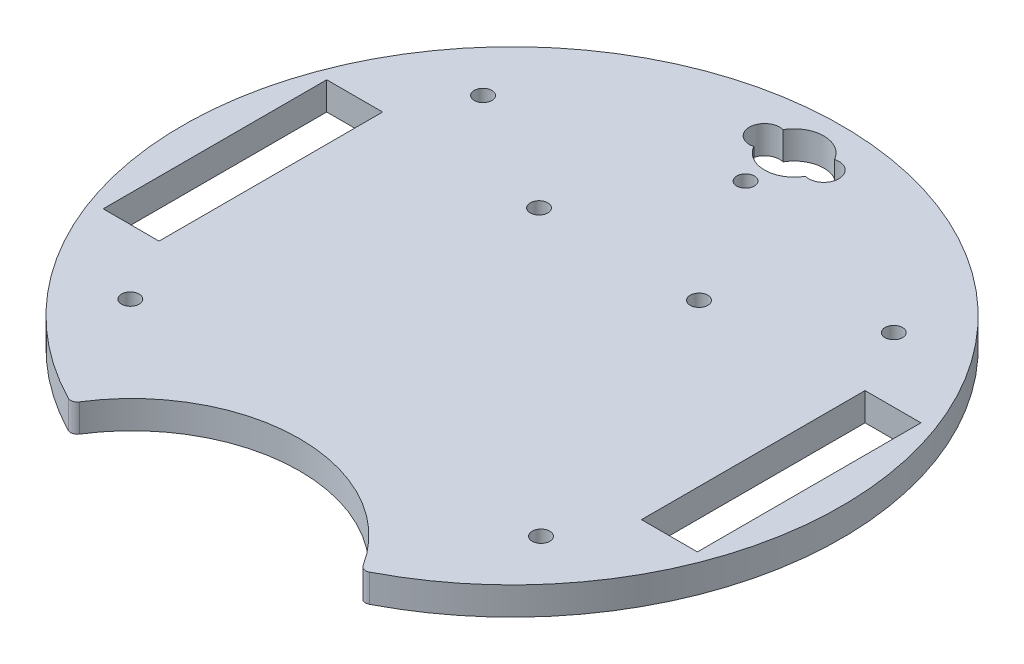
ISO-10303-21;
HEADER;
FILE_DESCRIPTION(('STEP AP214'),'2;1');
FILE_NAME('part.step','',(''),(''),'','','');
FILE_SCHEMA(('AUTOMOTIVE_DESIGN { 1 0 10303 214 1 1 1 1 }'));
ENDSEC;
DATA;
#1=APPLICATION_CONTEXT('core data for automotive mechanical design processes');
#2=APPLICATION_PROTOCOL_DEFINITION('international standard','automotive_design',2000,#1);
#3=PRODUCT_CONTEXT('',#1,'mechanical');
#4=PRODUCT('Part','Part','',(#3));
#5=PRODUCT_RELATED_PRODUCT_CATEGORY('part','',(#4));
#6=PRODUCT_DEFINITION_FORMATION('','',#4);
#7=PRODUCT_DEFINITION_CONTEXT('part definition',#1,'design');
#8=PRODUCT_DEFINITION('design','',#6,#7);
#9=PRODUCT_DEFINITION_SHAPE('','',#8);
#10=(LENGTH_UNIT() NAMED_UNIT(*) SI_UNIT(.MILLI.,.METRE.));
#11=(NAMED_UNIT(*) PLANE_ANGLE_UNIT() SI_UNIT($,.RADIAN.));
#12=(NAMED_UNIT(*) SI_UNIT($,.STERADIAN.) SOLID_ANGLE_UNIT());
#13=UNCERTAINTY_MEASURE_WITH_UNIT(LENGTH_MEASURE(1.E-05),#10,'distance_accuracy_value','');
#14=(GEOMETRIC_REPRESENTATION_CONTEXT(3) GLOBAL_UNCERTAINTY_ASSIGNED_CONTEXT((#13)) GLOBAL_UNIT_ASSIGNED_CONTEXT((#10,
#11,#12)) REPRESENTATION_CONTEXT('',''));
#15=CARTESIAN_POINT('',(0.,0.,0.));
#16=DIRECTION('',(0.,0.,1.));
#17=DIRECTION('',(1.,0.,0.));
#18=AXIS2_PLACEMENT_3D('',#15,#16,#17);
#19=CARTESIAN_POINT('',(0.,6.35,-64.1076988434385));
#20=DIRECTION('',(0.,-1.,0.));
#21=DIRECTION('',(0.,0.,-1.));
#22=AXIS2_PLACEMENT_3D('',#19,#20,#21);
#23=CYLINDRICAL_SURFACE('',#22,6.731);
#24=CARTESIAN_POINT('',(0.,0.,-64.1076988434385));
#25=DIRECTION('',(0.,1.,0.));
#26=DIRECTION('',(0.,0.,1.));
#27=AXIS2_PLACEMENT_3D('',#24,#25,#26);
#28=CIRCLE('',#27,6.731);
#29=CARTESIAN_POINT('',(-5.85389998799957,0.,-60.7853177800295));
#30=VERTEX_POINT('',#29);
#31=CARTESIAN_POINT('',(5.85757547169812,0.,-60.7918021934567));
#32=VERTEX_POINT('',#31);
#33=EDGE_CURVE('E234',#30,#32,#28,.T.);
#34=ORIENTED_EDGE('',*,*,#33,.F.);
#35=DIRECTION('',(0.,-1.,0.));
#36=VECTOR('',#35,1.);
#37=CARTESIAN_POINT('',(-5.85389998799957,6.35,-60.7853177800295));
#38=LINE('',#37,#36);
#39=CARTESIAN_POINT('',(-5.85389998799957,6.35,-60.7853177800295));
#40=VERTEX_POINT('',#39);
#41=EDGE_CURVE('E11',#40,#30,#38,.T.);
#42=ORIENTED_EDGE('',*,*,#41,.F.);
#43=CARTESIAN_POINT('',(0.,6.35,-64.1076988434385));
#44=DIRECTION('',(0.,1.,0.));
#45=DIRECTION('',(0.,0.,1.));
#46=AXIS2_PLACEMENT_3D('',#43,#44,#45);
#47=CIRCLE('',#46,6.731);
#48=CARTESIAN_POINT('',(5.85757547169812,6.35,-60.7918021934567));
#49=VERTEX_POINT('',#48);
#50=EDGE_CURVE('E169',#40,#49,#47,.T.);
#51=ORIENTED_EDGE('',*,*,#50,.T.);
#52=DIRECTION('',(0.,-1.,0.));
#53=VECTOR('',#52,1.);
#54=CARTESIAN_POINT('',(5.85757547169812,6.35,-60.7918021934567));
#55=LINE('',#54,#53);
#56=EDGE_CURVE('E52',#49,#32,#55,.T.);
#57=ORIENTED_EDGE('',*,*,#56,.T.);
#58=EDGE_LOOP('',(#34,#42,#51,#57));
#59=FACE_BOUND('',#58,.T.);
#60=ADVANCED_FACE('F33',(#59),#23,.F.);
#61=CARTESIAN_POINT('',(-6.731,6.35,-64.1076988434385));
#62=DIRECTION('',(0.,-1.,0.));
#63=DIRECTION('',(0.,0.,-1.));
#64=AXIS2_PLACEMENT_3D('',#61,#62,#63);
#65=CYLINDRICAL_SURFACE('',#64,3.43620726405579);
#66=CARTESIAN_POINT('',(-6.731,0.,-64.1076988434385));
#67=DIRECTION('',(0.,1.,0.));
#68=DIRECTION('',(0.,0.,1.));
#69=AXIS2_PLACEMENT_3D('',#66,#67,#68);
#70=CIRCLE('',#69,3.43620726405579);
#71=CARTESIAN_POINT('',(-5.85389998799957,0.,-67.4300799068475));
#72=VERTEX_POINT('',#71);
#73=EDGE_CURVE('E157',#72,#30,#70,.T.);
#74=ORIENTED_EDGE('',*,*,#73,.F.);
#75=DIRECTION('',(0.,-1.,0.));
#76=VECTOR('',#75,1.);
#77=CARTESIAN_POINT('',(-5.85389998799957,6.35,-67.4300799068475));
#78=LINE('',#77,#76);
#79=CARTESIAN_POINT('',(-5.85389998799957,6.35,-67.4300799068475));
#80=VERTEX_POINT('',#79);
#81=EDGE_CURVE('E43',#80,#72,#78,.T.);
#82=ORIENTED_EDGE('',*,*,#81,.F.);
#83=CARTESIAN_POINT('',(-6.731,6.35,-64.1076988434385));
#84=DIRECTION('',(0.,1.,0.));
#85=DIRECTION('',(0.,0.,1.));
#86=AXIS2_PLACEMENT_3D('',#83,#84,#85);
#87=CIRCLE('',#86,3.43620726405579);
#88=EDGE_CURVE('E155',#80,#40,#87,.T.);
#89=ORIENTED_EDGE('',*,*,#88,.T.);
#90=ORIENTED_EDGE('',*,*,#41,.T.);
#91=EDGE_LOOP('',(#74,#82,#89,#90));
#92=FACE_BOUND('',#91,.T.);
#93=ADVANCED_FACE('F154',(#92),#65,.F.);
#94=CARTESIAN_POINT('',(0.,6.35,-64.1076988434385));
#95=DIRECTION('',(0.,-1.,0.));
#96=DIRECTION('',(0.,0.,-1.));
#97=AXIS2_PLACEMENT_3D('',#94,#95,#96);
#98=CYLINDRICAL_SURFACE('',#97,6.731);
#99=CARTESIAN_POINT('',(0.,0.,-64.1076988434385));
#100=DIRECTION('',(0.,1.,0.));
#101=DIRECTION('',(0.,0.,1.));
#102=AXIS2_PLACEMENT_3D('',#99,#100,#101);
#103=CIRCLE('',#102,6.731);
#104=CARTESIAN_POINT('',(5.8575754716981,0.,-67.4235954934203));
#105=VERTEX_POINT('',#104);
#106=EDGE_CURVE('E237',#105,#72,#103,.T.);
#107=ORIENTED_EDGE('',*,*,#106,.F.);
#108=DIRECTION('',(0.,-1.,0.));
#109=VECTOR('',#108,1.);
#110=CARTESIAN_POINT('',(5.8575754716981,6.35,-67.4235954934203));
#111=LINE('',#110,#109);
#112=CARTESIAN_POINT('',(5.8575754716981,6.35,-67.4235954934203));
#113=VERTEX_POINT('',#112);
#114=EDGE_CURVE('E101',#113,#105,#111,.T.);
#115=ORIENTED_EDGE('',*,*,#114,.F.);
#116=CARTESIAN_POINT('',(0.,6.35,-64.1076988434385));
#117=DIRECTION('',(0.,1.,0.));
#118=DIRECTION('',(0.,0.,1.));
#119=AXIS2_PLACEMENT_3D('',#116,#117,#118);
#120=CIRCLE('',#119,6.731);
#121=EDGE_CURVE('E168',#113,#80,#120,.T.);
#122=ORIENTED_EDGE('',*,*,#121,.T.);
#123=ORIENTED_EDGE('',*,*,#81,.T.);
#124=EDGE_LOOP('',(#107,#115,#122,#123));
#125=FACE_BOUND('',#124,.T.);
#126=ADVANCED_FACE('F171',(#125),#98,.F.);
#127=CARTESIAN_POINT('',(0.,6.35,-25.4000000000001));
#128=DIRECTION('',(0.,0.,-1.));
#129=DIRECTION('',(-1.,0.,0.));
#130=AXIS2_PLACEMENT_3D('',#127,#128,#129);
#131=PLANE('',#130);
#132=DIRECTION('',(1.,0.,0.));
#133=VECTOR('',#132,1.);
#134=CARTESIAN_POINT('',(0.,0.,-25.4000000000001));
#135=LINE('',#134,#133);
#136=CARTESIAN_POINT('',(-67.5141237268841,0.,-25.4000000000001));
#137=VERTEX_POINT('',#136);
#138=CARTESIAN_POINT('',(-54.8141237268841,0.,-25.4000000000001));
#139=VERTEX_POINT('',#138);
#140=EDGE_CURVE('E223',#137,#139,#135,.T.);
#141=ORIENTED_EDGE('',*,*,#140,.T.);
#142=DIRECTION('',(0.,-1.,0.));
#143=VECTOR('',#142,1.);
#144=CARTESIAN_POINT('',(-54.8141237268841,6.35,-25.4000000000001));
#145=LINE('',#144,#143);
#146=CARTESIAN_POINT('',(-54.8141237268841,6.35,-25.4000000000001));
#147=VERTEX_POINT('',#146);
#148=EDGE_CURVE('E250',#147,#139,#145,.T.);
#149=ORIENTED_EDGE('',*,*,#148,.F.);
#150=DIRECTION('',(1.,0.,0.));
#151=VECTOR('',#150,1.);
#152=CARTESIAN_POINT('',(0.,6.35,-25.4000000000001));
#153=LINE('',#152,#151);
#154=CARTESIAN_POINT('',(-67.5141237268841,6.35,-25.4000000000001));
#155=VERTEX_POINT('',#154);
#156=EDGE_CURVE('E558',#155,#147,#153,.T.);
#157=ORIENTED_EDGE('',*,*,#156,.F.);
#158=DIRECTION('',(0.,-1.,0.));
#159=VECTOR('',#158,1.);
#160=CARTESIAN_POINT('',(-67.5141237268841,6.35,-25.4000000000001));
#161=LINE('',#160,#159);
#162=EDGE_CURVE('E252',#155,#137,#161,.T.);
#163=ORIENTED_EDGE('',*,*,#162,.T.);
#164=EDGE_LOOP('',(#141,#149,#157,#163));
#165=FACE_BOUND('',#164,.T.);
#166=ADVANCED_FACE('F328',(#165),#131,.F.);
#167=CARTESIAN_POINT('',(-54.8141237268841,6.35,0.));
#168=DIRECTION('',(1.,0.,0.));
#169=DIRECTION('',(0.,0.,-1.));
#170=AXIS2_PLACEMENT_3D('',#167,#168,#169);
#171=PLANE('',#170);
#172=DIRECTION('',(0.,0.,1.));
#173=VECTOR('',#172,1.);
#174=CARTESIAN_POINT('',(-54.8141237268841,0.,0.));
#175=LINE('',#174,#173);
#176=CARTESIAN_POINT('',(-54.8141237268841,0.,25.3999999999999));
#177=VERTEX_POINT('',#176);
#178=EDGE_CURVE('E226',#139,#177,#175,.T.);
#179=ORIENTED_EDGE('',*,*,#178,.T.);
#180=DIRECTION('',(0.,-1.,0.));
#181=VECTOR('',#180,1.);
#182=CARTESIAN_POINT('',(-54.8141237268841,6.35,25.3999999999999));
#183=LINE('',#182,#181);
#184=CARTESIAN_POINT('',(-54.8141237268841,6.35,25.3999999999999));
#185=VERTEX_POINT('',#184);
#186=EDGE_CURVE('E258',#185,#177,#183,.T.);
#187=ORIENTED_EDGE('',*,*,#186,.F.);
#188=DIRECTION('',(0.,0.,1.));
#189=VECTOR('',#188,1.);
#190=CARTESIAN_POINT('',(-54.8141237268841,6.35,0.));
#191=LINE('',#190,#189);
#192=EDGE_CURVE('E561',#147,#185,#191,.T.);
#193=ORIENTED_EDGE('',*,*,#192,.F.);
#194=ORIENTED_EDGE('',*,*,#148,.T.);
#195=EDGE_LOOP('',(#179,#187,#193,#194));
#196=FACE_BOUND('',#195,.T.);
#197=ADVANCED_FACE('F324',(#196),#171,.F.);
#198=CARTESIAN_POINT('',(0.,6.35,25.3999999999999));
#199=DIRECTION('',(0.,0.,-1.));
#200=DIRECTION('',(-1.,0.,0.));
#201=AXIS2_PLACEMENT_3D('',#198,#199,#200);
#202=PLANE('',#201);
#203=DIRECTION('',(1.,0.,0.));
#204=VECTOR('',#203,1.);
#205=CARTESIAN_POINT('',(0.,0.,25.3999999999999));
#206=LINE('',#205,#204);
#207=CARTESIAN_POINT('',(-67.5141237268841,0.,25.3999999999999));
#208=VERTEX_POINT('',#207);
#209=EDGE_CURVE('E229',#208,#177,#206,.T.);
#210=ORIENTED_EDGE('',*,*,#209,.F.);
#211=DIRECTION('',(0.,-1.,0.));
#212=VECTOR('',#211,1.);
#213=CARTESIAN_POINT('',(-67.5141237268841,6.35,25.3999999999999));
#214=LINE('',#213,#212);
#215=CARTESIAN_POINT('',(-67.5141237268841,6.35,25.3999999999999));
#216=VERTEX_POINT('',#215);
#217=EDGE_CURVE('E255',#216,#208,#214,.T.);
#218=ORIENTED_EDGE('',*,*,#217,.F.);
#219=DIRECTION('',(1.,0.,0.));
#220=VECTOR('',#219,1.);
#221=CARTESIAN_POINT('',(0.,6.35,25.3999999999999));
#222=LINE('',#221,#220);
#223=EDGE_CURVE('E570',#216,#185,#222,.T.);
#224=ORIENTED_EDGE('',*,*,#223,.T.);
#225=ORIENTED_EDGE('',*,*,#186,.T.);
#226=EDGE_LOOP('',(#210,#218,#224,#225));
#227=FACE_BOUND('',#226,.T.);
#228=ADVANCED_FACE('F320',(#227),#202,.T.);
#229=CARTESIAN_POINT('',(67.5141237268841,6.35,0.));
#230=DIRECTION('',(-1.,0.,0.));
#231=DIRECTION('',(0.,0.,1.));
#232=AXIS2_PLACEMENT_3D('',#229,#230,#231);
#233=PLANE('',#232);
#234=DIRECTION('',(0.,0.,-1.));
#235=VECTOR('',#234,1.);
#236=CARTESIAN_POINT('',(67.5141237268841,0.,0.));
#237=LINE('',#236,#235);
#238=CARTESIAN_POINT('',(67.5141237268841,0.,25.3999999999999));
#239=VERTEX_POINT('',#238);
#240=CARTESIAN_POINT('',(67.5141237268841,0.,-25.4000000000001));
#241=VERTEX_POINT('',#240);
#242=EDGE_CURVE('E211',#239,#241,#237,.T.);
#243=ORIENTED_EDGE('',*,*,#242,.F.);
#244=DIRECTION('',(0.,-1.,0.));
#245=VECTOR('',#244,1.);
#246=CARTESIAN_POINT('',(67.5141237268841,6.35,25.3999999999999));
#247=LINE('',#246,#245);
#248=CARTESIAN_POINT('',(67.5141237268841,6.35,25.3999999999999));
#249=VERTEX_POINT('',#248);
#250=EDGE_CURVE('E256',#249,#239,#247,.T.);
#251=ORIENTED_EDGE('',*,*,#250,.F.);
#252=DIRECTION('',(0.,0.,-1.));
#253=VECTOR('',#252,1.);
#254=CARTESIAN_POINT('',(67.5141237268841,6.35,0.));
#255=LINE('',#254,#253);
#256=CARTESIAN_POINT('',(67.5141237268841,6.35,-25.4000000000001));
#257=VERTEX_POINT('',#256);
#258=EDGE_CURVE('E555',#249,#257,#255,.T.);
#259=ORIENTED_EDGE('',*,*,#258,.T.);
#260=DIRECTION('',(0.,-1.,0.));
#261=VECTOR('',#260,1.);
#262=CARTESIAN_POINT('',(67.5141237268841,6.35,-25.4000000000001));
#263=LINE('',#262,#261);
#264=EDGE_CURVE('E262',#257,#241,#263,.T.);
#265=ORIENTED_EDGE('',*,*,#264,.T.);
#266=EDGE_LOOP('',(#243,#251,#259,#265));
#267=FACE_BOUND('',#266,.T.);
#268=ADVANCED_FACE('F323',(#267),#233,.T.);
#269=CARTESIAN_POINT('',(0.,6.35,25.3999999999999));
#270=DIRECTION('',(0.,0.,1.));
#271=DIRECTION('',(1.,0.,0.));
#272=AXIS2_PLACEMENT_3D('',#269,#270,#271);
#273=PLANE('',#272);
#274=DIRECTION('',(-1.,0.,0.));
#275=VECTOR('',#274,1.);
#276=CARTESIAN_POINT('',(0.,0.,25.3999999999999));
#277=LINE('',#276,#275);
#278=CARTESIAN_POINT('',(54.8141237268841,0.,25.3999999999999));
#279=VERTEX_POINT('',#278);
#280=EDGE_CURVE('E214',#239,#279,#277,.T.);
#281=ORIENTED_EDGE('',*,*,#280,.T.);
#282=DIRECTION('',(0.,-1.,0.));
#283=VECTOR('',#282,1.);
#284=CARTESIAN_POINT('',(54.8141237268841,6.35,25.3999999999999));
#285=LINE('',#284,#283);
#286=CARTESIAN_POINT('',(54.8141237268841,6.35,25.3999999999999));
#287=VERTEX_POINT('',#286);
#288=EDGE_CURVE('E266',#287,#279,#285,.T.);
#289=ORIENTED_EDGE('',*,*,#288,.F.);
#290=DIRECTION('',(-1.,0.,0.));
#291=VECTOR('',#290,1.);
#292=CARTESIAN_POINT('',(0.,6.35,25.3999999999999));
#293=LINE('',#292,#291);
#294=EDGE_CURVE('E586',#249,#287,#293,.T.);
#295=ORIENTED_EDGE('',*,*,#294,.F.);
#296=ORIENTED_EDGE('',*,*,#250,.T.);
#297=EDGE_LOOP('',(#281,#289,#295,#296));
#298=FACE_BOUND('',#297,.T.);
#299=ADVANCED_FACE('F340',(#298),#273,.F.);
#300=CARTESIAN_POINT('',(54.8141237268841,6.35,0.));
#301=DIRECTION('',(-1.,0.,0.));
#302=DIRECTION('',(0.,0.,1.));
#303=AXIS2_PLACEMENT_3D('',#300,#301,#302);
#304=PLANE('',#303);
#305=DIRECTION('',(0.,0.,-1.));
#306=VECTOR('',#305,1.);
#307=CARTESIAN_POINT('',(54.8141237268841,0.,0.));
#308=LINE('',#307,#306);
#309=CARTESIAN_POINT('',(54.8141237268841,0.,-25.4000000000001));
#310=VERTEX_POINT('',#309);
#311=EDGE_CURVE('E217',#279,#310,#308,.T.);
#312=ORIENTED_EDGE('',*,*,#311,.T.);
#313=DIRECTION('',(0.,-1.,0.));
#314=VECTOR('',#313,1.);
#315=CARTESIAN_POINT('',(54.8141237268841,6.35,-25.4000000000001));
#316=LINE('',#315,#314);
#317=CARTESIAN_POINT('',(54.8141237268841,6.35,-25.4000000000001));
#318=VERTEX_POINT('',#317);
#319=EDGE_CURVE('E264',#318,#310,#316,.T.);
#320=ORIENTED_EDGE('',*,*,#319,.F.);
#321=DIRECTION('',(0.,0.,-1.));
#322=VECTOR('',#321,1.);
#323=CARTESIAN_POINT('',(54.8141237268841,6.35,0.));
#324=LINE('',#323,#322);
#325=EDGE_CURVE('E584',#287,#318,#324,.T.);
#326=ORIENTED_EDGE('',*,*,#325,.F.);
#327=ORIENTED_EDGE('',*,*,#288,.T.);
#328=EDGE_LOOP('',(#312,#320,#326,#327));
#329=FACE_BOUND('',#328,.T.);
#330=ADVANCED_FACE('F337',(#329),#304,.F.);
#331=CARTESIAN_POINT('',(33.5100001196225,6.35,65.3012960955778));
#332=DIRECTION('',(0.,-1.,0.));
#333=DIRECTION('',(0.,0.,-1.));
#334=AXIS2_PLACEMENT_3D('',#331,#332,#333);
#335=CYLINDRICAL_SURFACE('',#334,1.50000000000011);
#336=CARTESIAN_POINT('',(33.5100001196225,0.,65.3012960955778));
#337=DIRECTION('',(0.,1.,0.));
#338=DIRECTION('',(0.,0.,1.));
#339=AXIS2_PLACEMENT_3D('',#336,#337,#338);
#340=CIRCLE('',#339,1.50000000000011);
#341=CARTESIAN_POINT('',(34.1948335778492,0.,66.6358383895849));
#342=VERTEX_POINT('',#341);
#343=CARTESIAN_POINT('',(32.2406819332729,0.,66.100565350462));
#344=VERTEX_POINT('',#343);
#345=EDGE_CURVE('E190',#342,#344,#340,.F.);
#346=ORIENTED_EDGE('',*,*,#345,.F.);
#347=DIRECTION('',(0.,-1.,0.));
#348=VECTOR('',#347,1.);
#349=CARTESIAN_POINT('',(34.1948335778492,6.35,66.6358383895849));
#350=LINE('',#349,#348);
#351=CARTESIAN_POINT('',(34.1948335778492,6.35,66.6358383895849));
#352=VERTEX_POINT('',#351);
#353=EDGE_CURVE('E37',#352,#342,#350,.T.);
#354=ORIENTED_EDGE('',*,*,#353,.F.);
#355=CARTESIAN_POINT('',(33.5100001196225,6.35,65.3012960955778));
#356=DIRECTION('',(0.,1.,0.));
#357=DIRECTION('',(0.,0.,1.));
#358=AXIS2_PLACEMENT_3D('',#355,#356,#357);
#359=CIRCLE('',#358,1.50000000000011);
#360=CARTESIAN_POINT('',(32.2406819332729,6.35,66.100565350462));
#361=VERTEX_POINT('',#360);
#362=EDGE_CURVE('E287',#352,#361,#359,.F.);
#363=ORIENTED_EDGE('',*,*,#362,.T.);
#364=DIRECTION('',(0.,-1.,0.));
#365=VECTOR('',#364,1.);
#366=CARTESIAN_POINT('',(32.2406819332729,6.35,66.100565350462));
#367=LINE('',#366,#365);
#368=EDGE_CURVE('E183',#361,#344,#367,.T.);
#369=ORIENTED_EDGE('',*,*,#368,.T.);
#370=EDGE_LOOP('',(#346,#354,#363,#369));
#371=FACE_BOUND('',#370,.T.);
#372=ADVANCED_FACE('F286',(#371),#335,.T.);
#373=CARTESIAN_POINT('',(0.,6.35,0.));
#374=DIRECTION('',(0.,-1.,0.));
#375=DIRECTION('',(0.,0.,-1.));
#376=AXIS2_PLACEMENT_3D('',#373,#374,#375);
#377=CYLINDRICAL_SURFACE('',#376,74.8974071734108);
#378=CARTESIAN_POINT('',(0.,0.,0.));
#379=DIRECTION('',(0.,1.,0.));
#380=DIRECTION('',(0.,0.,1.));
#381=AXIS2_PLACEMENT_3D('',#378,#379,#380);
#382=CIRCLE('',#381,74.8974071734108);
#383=CARTESIAN_POINT('',(-34.1948335778492,0.,66.6358383895849));
#384=VERTEX_POINT('',#383);
#385=EDGE_CURVE('E193',#342,#384,#382,.T.);
#386=ORIENTED_EDGE('',*,*,#385,.T.);
#387=DIRECTION('',(0.,-1.,0.));
#388=VECTOR('',#387,1.);
#389=CARTESIAN_POINT('',(-34.1948335778492,6.35,66.6358383895849));
#390=LINE('',#389,#388);
#391=CARTESIAN_POINT('',(-34.1948335778492,6.35,66.6358383895849));
#392=VERTEX_POINT('',#391);
#393=EDGE_CURVE('E272',#392,#384,#390,.T.);
#394=ORIENTED_EDGE('',*,*,#393,.F.);
#395=CARTESIAN_POINT('',(0.,6.35,0.));
#396=DIRECTION('',(0.,1.,0.));
#397=DIRECTION('',(0.,0.,1.));
#398=AXIS2_PLACEMENT_3D('',#395,#396,#397);
#399=CIRCLE('',#398,74.8974071734108);
#400=EDGE_CURVE('E280',#352,#392,#399,.T.);
#401=ORIENTED_EDGE('',*,*,#400,.F.);
#402=ORIENTED_EDGE('',*,*,#353,.T.);
#403=EDGE_LOOP('',(#386,#394,#401,#402));
#404=FACE_BOUND('',#403,.T.);
#405=ADVANCED_FACE('F278',(#404),#377,.T.);
#406=CARTESIAN_POINT('',(-33.5100001196225,6.35,65.3012960955779));
#407=DIRECTION('',(0.,-1.,0.));
#408=DIRECTION('',(0.,0.,-1.));
#409=AXIS2_PLACEMENT_3D('',#406,#407,#408);
#410=CYLINDRICAL_SURFACE('',#409,1.50000000000026);
#411=CARTESIAN_POINT('',(-33.5100001196225,0.,65.3012960955779));
#412=DIRECTION('',(0.,1.,0.));
#413=DIRECTION('',(0.,0.,1.));
#414=AXIS2_PLACEMENT_3D('',#411,#412,#413);
#415=CIRCLE('',#414,1.50000000000026);
#416=CARTESIAN_POINT('',(-32.2406819332729,0.,66.100565350462));
#417=VERTEX_POINT('',#416);
#418=EDGE_CURVE('E196',#384,#417,#415,.T.);
#419=ORIENTED_EDGE('',*,*,#418,.T.);
#420=DIRECTION('',(0.,-1.,0.));
#421=VECTOR('',#420,1.);
#422=CARTESIAN_POINT('',(-32.2406819332729,6.35,66.100565350462));
#423=LINE('',#422,#421);
#424=CARTESIAN_POINT('',(-32.2406819332729,6.35,66.100565350462));
#425=VERTEX_POINT('',#424);
#426=EDGE_CURVE('E271',#425,#417,#423,.T.);
#427=ORIENTED_EDGE('',*,*,#426,.F.);
#428=CARTESIAN_POINT('',(-33.5100001196225,6.35,65.3012960955779));
#429=DIRECTION('',(0.,1.,0.));
#430=DIRECTION('',(0.,0.,1.));
#431=AXIS2_PLACEMENT_3D('',#428,#429,#430);
#432=CIRCLE('',#431,1.50000000000026);
#433=EDGE_CURVE('E593',#392,#425,#432,.T.);
#434=ORIENTED_EDGE('',*,*,#433,.F.);
#435=ORIENTED_EDGE('',*,*,#393,.T.);
#436=EDGE_LOOP('',(#419,#427,#434,#435));
#437=FACE_BOUND('',#436,.T.);
#438=ADVANCED_FACE('F294',(#437),#410,.T.);
#439=CARTESIAN_POINT('',(-18.1789527954067,6.35,-24.3105510962522));
#440=DIRECTION('',(0.,-1.,0.));
#441=DIRECTION('',(0.,0.,-1.));
#442=AXIS2_PLACEMENT_3D('',#439,#440,#441);
#443=CYLINDRICAL_SURFACE('',#442,2.);
#444=CARTESIAN_POINT('',(-18.1789527954067,6.35,-24.3105510962522));
#445=DIRECTION('',(0.,1.,0.));
#446=DIRECTION('',(0.,0.,1.));
#447=AXIS2_PLACEMENT_3D('',#444,#445,#446);
#448=CIRCLE('',#447,2.);
#449=CARTESIAN_POINT('',(-18.1789527954067,6.35,-22.3105510962522));
#450=VERTEX_POINT('',#449);
#451=EDGE_CURVE('E174',#450,#450,#448,.F.);
#452=ORIENTED_EDGE('',*,*,#451,.F.);
#453=EDGE_LOOP('',(#452));
#454=FACE_BOUND('',#453,.T.);
#455=CARTESIAN_POINT('',(-18.1789527954067,0.,-24.3105510962522));
#456=DIRECTION('',(0.,1.,0.));
#457=DIRECTION('',(0.,0.,1.));
#458=AXIS2_PLACEMENT_3D('',#455,#456,#457);
#459=CIRCLE('',#458,2.);
#460=CARTESIAN_POINT('',(-18.1789527954067,0.,-22.3105510962522));
#461=VERTEX_POINT('',#460);
#462=EDGE_CURVE('E242',#461,#461,#459,.F.);
#463=ORIENTED_EDGE('',*,*,#462,.T.);
#464=EDGE_LOOP('',(#463));
#465=FACE_BOUND('',#464,.T.);
#466=ADVANCED_FACE('F296',(#454,#465),#443,.F.);
#467=CARTESIAN_POINT('',(6.731,6.35,-64.1076988434385));
#468=DIRECTION('',(0.,-1.,0.));
#469=DIRECTION('',(0.,0.,-1.));
#470=AXIS2_PLACEMENT_3D('',#467,#468,#469);
#471=CYLINDRICAL_SURFACE('',#470,3.429);
#472=CARTESIAN_POINT('',(6.731,0.,-64.1076988434385));
#473=DIRECTION('',(0.,1.,0.));
#474=DIRECTION('',(0.,0.,1.));
#475=AXIS2_PLACEMENT_3D('',#472,#473,#474);
#476=CIRCLE('',#475,3.429);
#477=EDGE_CURVE('E239',#32,#105,#476,.T.);
#478=ORIENTED_EDGE('',*,*,#477,.F.);
#479=ORIENTED_EDGE('',*,*,#56,.F.);
#480=CARTESIAN_POINT('',(6.731,6.35,-64.1076988434385));
#481=DIRECTION('',(0.,1.,0.));
#482=DIRECTION('',(0.,0.,1.));
#483=AXIS2_PLACEMENT_3D('',#480,#481,#482);
#484=CIRCLE('',#483,3.429);
#485=EDGE_CURVE('E172',#49,#113,#484,.T.);
#486=ORIENTED_EDGE('',*,*,#485,.T.);
#487=ORIENTED_EDGE('',*,*,#114,.T.);
#488=EDGE_LOOP('',(#478,#479,#486,#487));
#489=FACE_BOUND('',#488,.T.);
#490=ADVANCED_FACE('F302',(#489),#471,.F.);
#491=CARTESIAN_POINT('',(-67.5141237268841,6.35,0.));
#492=DIRECTION('',(-1.,0.,0.));
#493=DIRECTION('',(0.,0.,1.));
#494=AXIS2_PLACEMENT_3D('',#491,#492,#493);
#495=PLANE('',#494);
#496=DIRECTION('',(0.,0.,-1.));
#497=VECTOR('',#496,1.);
#498=CARTESIAN_POINT('',(-67.5141237268841,0.,0.));
#499=LINE('',#498,#497);
#500=EDGE_CURVE('E232',#208,#137,#499,.T.);
#501=ORIENTED_EDGE('',*,*,#500,.T.);
#502=ORIENTED_EDGE('',*,*,#162,.F.);
#503=DIRECTION('',(0.,0.,-1.));
#504=VECTOR('',#503,1.);
#505=CARTESIAN_POINT('',(-67.5141237268841,6.35,0.));
#506=LINE('',#505,#504);
#507=EDGE_CURVE('E564',#216,#155,#506,.T.);
#508=ORIENTED_EDGE('',*,*,#507,.F.);
#509=ORIENTED_EDGE('',*,*,#217,.T.);
#510=EDGE_LOOP('',(#501,#502,#508,#509));
#511=FACE_BOUND('',#510,.T.);
#512=ADVANCED_FACE('F315',(#511),#495,.F.);
#513=CARTESIAN_POINT('',(0.,6.35,-25.4000000000001));
#514=DIRECTION('',(0.,0.,1.));
#515=DIRECTION('',(1.,0.,0.));
#516=AXIS2_PLACEMENT_3D('',#513,#514,#515);
#517=PLANE('',#516);
#518=DIRECTION('',(-1.,0.,0.));
#519=VECTOR('',#518,1.);
#520=CARTESIAN_POINT('',(0.,0.,-25.4000000000001));
#521=LINE('',#520,#519);
#522=EDGE_CURVE('E220',#241,#310,#521,.T.);
#523=ORIENTED_EDGE('',*,*,#522,.F.);
#524=ORIENTED_EDGE('',*,*,#264,.F.);
#525=DIRECTION('',(-1.,0.,0.));
#526=VECTOR('',#525,1.);
#527=CARTESIAN_POINT('',(0.,6.35,-25.4000000000001));
#528=LINE('',#527,#526);
#529=EDGE_CURVE('E566',#257,#318,#528,.T.);
#530=ORIENTED_EDGE('',*,*,#529,.T.);
#531=ORIENTED_EDGE('',*,*,#319,.T.);
#532=EDGE_LOOP('',(#523,#524,#530,#531));
#533=FACE_BOUND('',#532,.T.);
#534=ADVANCED_FACE('F318',(#533),#517,.T.);
#535=CARTESIAN_POINT('',(-46.6637339832601,6.35,40.0812318826666));
#536=DIRECTION('',(0.,-1.,0.));
#537=DIRECTION('',(0.,0.,-1.));
#538=AXIS2_PLACEMENT_3D('',#535,#536,#537);
#539=CYLINDRICAL_SURFACE('',#538,2.);
#540=CARTESIAN_POINT('',(-46.6637339832601,6.35,40.0812318826666));
#541=DIRECTION('',(0.,1.,0.));
#542=DIRECTION('',(0.,0.,1.));
#543=AXIS2_PLACEMENT_3D('',#540,#541,#542);
#544=CIRCLE('',#543,2.);
#545=CARTESIAN_POINT('',(-46.6637339832601,6.35,42.0812318826666));
#546=VERTEX_POINT('',#545);
#547=EDGE_CURVE('E549',#546,#546,#544,.T.);
#548=ORIENTED_EDGE('',*,*,#547,.T.);
#549=EDGE_LOOP('',(#548));
#550=FACE_BOUND('',#549,.T.);
#551=CARTESIAN_POINT('',(-46.6637339832601,0.,40.0812318826666));
#552=DIRECTION('',(0.,1.,0.));
#553=DIRECTION('',(0.,0.,1.));
#554=AXIS2_PLACEMENT_3D('',#551,#552,#553);
#555=CIRCLE('',#554,2.);
#556=CARTESIAN_POINT('',(-46.6637339832601,0.,42.0812318826666));
#557=VERTEX_POINT('',#556);
#558=EDGE_CURVE('E208',#557,#557,#555,.T.);
#559=ORIENTED_EDGE('',*,*,#558,.F.);
#560=EDGE_LOOP('',(#559));
#561=FACE_BOUND('',#560,.T.);
#562=ADVANCED_FACE('F335',(#550,#561),#539,.F.);
#563=CARTESIAN_POINT('',(46.6637339832601,6.35,40.0812318826666));
#564=DIRECTION('',(0.,-1.,0.));
#565=DIRECTION('',(0.,0.,-1.));
#566=AXIS2_PLACEMENT_3D('',#563,#564,#565);
#567=CYLINDRICAL_SURFACE('',#566,2.);
#568=CARTESIAN_POINT('',(46.6637339832601,6.35,40.0812318826666));
#569=DIRECTION('',(0.,1.,0.));
#570=DIRECTION('',(0.,0.,1.));
#571=AXIS2_PLACEMENT_3D('',#568,#569,#570);
#572=CIRCLE('',#571,2.);
#573=CARTESIAN_POINT('',(46.6637339832601,6.35,42.0812318826666));
#574=VERTEX_POINT('',#573);
#575=EDGE_CURVE('E545',#574,#574,#572,.T.);
#576=ORIENTED_EDGE('',*,*,#575,.T.);
#577=EDGE_LOOP('',(#576));
#578=FACE_BOUND('',#577,.T.);
#579=CARTESIAN_POINT('',(46.6637339832601,0.,40.0812318826666));
#580=DIRECTION('',(0.,1.,0.));
#581=DIRECTION('',(0.,0.,1.));
#582=AXIS2_PLACEMENT_3D('',#579,#580,#581);
#583=CIRCLE('',#582,2.);
#584=CARTESIAN_POINT('',(46.6637339832601,0.,42.0812318826666));
#585=VERTEX_POINT('',#584);
#586=EDGE_CURVE('E205',#585,#585,#583,.T.);
#587=ORIENTED_EDGE('',*,*,#586,.F.);
#588=EDGE_LOOP('',(#587));
#589=FACE_BOUND('',#588,.T.);
#590=ADVANCED_FACE('F350',(#578,#589),#567,.F.);
#591=CARTESIAN_POINT('',(46.6637339832601,6.35,-40.0812318826666));
#592=DIRECTION('',(0.,-1.,0.));
#593=DIRECTION('',(0.,0.,-1.));
#594=AXIS2_PLACEMENT_3D('',#591,#592,#593);
#595=CYLINDRICAL_SURFACE('',#594,2.);
#596=CARTESIAN_POINT('',(46.6637339832601,6.35,-40.0812318826666));
#597=DIRECTION('',(0.,1.,0.));
#598=DIRECTION('',(0.,0.,1.));
#599=AXIS2_PLACEMENT_3D('',#596,#597,#598);
#600=CIRCLE('',#599,2.);
#601=CARTESIAN_POINT('',(46.6637339832601,6.35,-38.0812318826666));
#602=VERTEX_POINT('',#601);
#603=EDGE_CURVE('E541',#602,#602,#600,.F.);
#604=ORIENTED_EDGE('',*,*,#603,.F.);
#605=EDGE_LOOP('',(#604));
#606=FACE_BOUND('',#605,.T.);
#607=CARTESIAN_POINT('',(46.6637339832601,0.,-40.0812318826666));
#608=DIRECTION('',(0.,1.,0.));
#609=DIRECTION('',(0.,0.,1.));
#610=AXIS2_PLACEMENT_3D('',#607,#608,#609);
#611=CIRCLE('',#610,2.);
#612=CARTESIAN_POINT('',(46.6637339832601,0.,-38.0812318826666));
#613=VERTEX_POINT('',#612);
#614=EDGE_CURVE('E202',#613,#613,#611,.F.);
#615=ORIENTED_EDGE('',*,*,#614,.T.);
#616=EDGE_LOOP('',(#615));
#617=FACE_BOUND('',#616,.T.);
#618=ADVANCED_FACE('F354',(#606,#617),#595,.F.);
#619=CARTESIAN_POINT('',(0.,6.35,86.4020044245157));
#620=DIRECTION('',(0.,-1.,0.));
#621=DIRECTION('',(0.,0.,-1.));
#622=AXIS2_PLACEMENT_3D('',#619,#620,#621);
#623=CYLINDRICAL_SURFACE('',#622,38.0999999999998);
#624=CARTESIAN_POINT('',(0.,0.,86.4020044245157));
#625=DIRECTION('',(0.,1.,0.));
#626=DIRECTION('',(0.,0.,1.));
#627=AXIS2_PLACEMENT_3D('',#624,#625,#626);
#628=CIRCLE('',#627,38.0999999999998);
#629=EDGE_CURVE('E199',#344,#417,#628,.T.);
#630=ORIENTED_EDGE('',*,*,#629,.F.);
#631=ORIENTED_EDGE('',*,*,#368,.F.);
#632=CARTESIAN_POINT('',(0.,6.35,86.4020044245157));
#633=DIRECTION('',(0.,1.,0.));
#634=DIRECTION('',(0.,0.,1.));
#635=AXIS2_PLACEMENT_3D('',#632,#633,#634);
#636=CIRCLE('',#635,38.0999999999998);
#637=EDGE_CURVE('E292',#361,#425,#636,.T.);
#638=ORIENTED_EDGE('',*,*,#637,.T.);
#639=ORIENTED_EDGE('',*,*,#426,.T.);
#640=EDGE_LOOP('',(#630,#631,#638,#639));
#641=FACE_BOUND('',#640,.T.);
#642=ADVANCED_FACE('F291',(#641),#623,.F.);
#643=CARTESIAN_POINT('',(18.1789527954067,6.35,-24.3105510962522));
#644=DIRECTION('',(0.,-1.,0.));
#645=DIRECTION('',(0.,0.,-1.));
#646=AXIS2_PLACEMENT_3D('',#643,#644,#645);
#647=CYLINDRICAL_SURFACE('',#646,2.);
#648=CARTESIAN_POINT('',(18.1789527954067,6.35,-24.3105510962522));
#649=DIRECTION('',(0.,1.,0.));
#650=DIRECTION('',(0.,0.,1.));
#651=AXIS2_PLACEMENT_3D('',#648,#649,#650);
#652=CIRCLE('',#651,2.);
#653=CARTESIAN_POINT('',(18.1789527954067,6.35,-22.3105510962522));
#654=VERTEX_POINT('',#653);
#655=EDGE_CURVE('E536',#654,#654,#652,.T.);
#656=ORIENTED_EDGE('',*,*,#655,.T.);
#657=EDGE_LOOP('',(#656));
#658=FACE_BOUND('',#657,.T.);
#659=CARTESIAN_POINT('',(18.1789527954067,0.,-24.3105510962522));
#660=DIRECTION('',(0.,1.,0.));
#661=DIRECTION('',(0.,0.,1.));
#662=AXIS2_PLACEMENT_3D('',#659,#660,#661);
#663=CIRCLE('',#662,2.);
#664=CARTESIAN_POINT('',(18.1789527954067,0.,-22.3105510962522));
#665=VERTEX_POINT('',#664);
#666=EDGE_CURVE('E187',#665,#665,#663,.T.);
#667=ORIENTED_EDGE('',*,*,#666,.F.);
#668=EDGE_LOOP('',(#667));
#669=FACE_BOUND('',#668,.T.);
#670=ADVANCED_FACE('F359',(#658,#669),#647,.F.);
#671=CARTESIAN_POINT('',(0.,6.35,-53.0611879648997));
#672=DIRECTION('',(0.,-1.,0.));
#673=DIRECTION('',(0.,0.,-1.));
#674=AXIS2_PLACEMENT_3D('',#671,#672,#673);
#675=CYLINDRICAL_SURFACE('',#674,2.);
#676=CARTESIAN_POINT('',(0.,6.35,-53.0611879648997));
#677=DIRECTION('',(0.,1.,0.));
#678=DIRECTION('',(0.,0.,1.));
#679=AXIS2_PLACEMENT_3D('',#676,#677,#678);
#680=CIRCLE('',#679,2.);
#681=CARTESIAN_POINT('',(0.,6.35,-51.0611879648997));
#682=VERTEX_POINT('',#681);
#683=EDGE_CURVE('E248',#682,#682,#680,.T.);
#684=ORIENTED_EDGE('',*,*,#683,.T.);
#685=EDGE_LOOP('',(#684));
#686=FACE_BOUND('',#685,.T.);
#687=CARTESIAN_POINT('',(0.,0.,-53.0611879648997));
#688=DIRECTION('',(0.,1.,0.));
#689=DIRECTION('',(0.,0.,1.));
#690=AXIS2_PLACEMENT_3D('',#687,#688,#689);
#691=CIRCLE('',#690,2.);
#692=CARTESIAN_POINT('',(0.,0.,-51.0611879648997));
#693=VERTEX_POINT('',#692);
#694=EDGE_CURVE('E184',#693,#693,#691,.T.);
#695=ORIENTED_EDGE('',*,*,#694,.F.);
#696=EDGE_LOOP('',(#695));
#697=FACE_BOUND('',#696,.T.);
#698=ADVANCED_FACE('F35',(#686,#697),#675,.F.);
#699=CARTESIAN_POINT('',(-46.6637339832601,6.35,-40.0812318826666));
#700=DIRECTION('',(0.,-1.,0.));
#701=DIRECTION('',(0.,0.,-1.));
#702=AXIS2_PLACEMENT_3D('',#699,#700,#701);
#703=CYLINDRICAL_SURFACE('',#702,2.);
#704=CARTESIAN_POINT('',(-46.6637339832601,6.35,-40.0812318826666));
#705=DIRECTION('',(0.,1.,0.));
#706=DIRECTION('',(0.,0.,1.));
#707=AXIS2_PLACEMENT_3D('',#704,#705,#706);
#708=CIRCLE('',#707,2.);
#709=CARTESIAN_POINT('',(-46.6637339832601,6.35,-38.0812318826666));
#710=VERTEX_POINT('',#709);
#711=EDGE_CURVE('E180',#710,#710,#708,.F.);
#712=ORIENTED_EDGE('',*,*,#711,.F.);
#713=EDGE_LOOP('',(#712));
#714=FACE_BOUND('',#713,.T.);
#715=CARTESIAN_POINT('',(-46.6637339832601,0.,-40.0812318826666));
#716=DIRECTION('',(0.,1.,0.));
#717=DIRECTION('',(0.,0.,1.));
#718=AXIS2_PLACEMENT_3D('',#715,#716,#717);
#719=CIRCLE('',#718,2.);
#720=CARTESIAN_POINT('',(-46.6637339832601,0.,-38.0812318826666));
#721=VERTEX_POINT('',#720);
#722=EDGE_CURVE('E245',#721,#721,#719,.F.);
#723=ORIENTED_EDGE('',*,*,#722,.T.);
#724=EDGE_LOOP('',(#723));
#725=FACE_BOUND('',#724,.T.);
#726=ADVANCED_FACE('F367',(#714,#725),#703,.F.);
#727=CARTESIAN_POINT('',(0.,6.35,0.));
#728=DIRECTION('',(0.,1.,0.));
#729=DIRECTION('',(0.,0.,1.));
#730=AXIS2_PLACEMENT_3D('',#727,#728,#729);
#731=PLANE('',#730);
#732=ORIENTED_EDGE('',*,*,#683,.F.);
#733=EDGE_LOOP('',(#732));
#734=FACE_BOUND('',#733,.T.);
#735=ORIENTED_EDGE('',*,*,#655,.F.);
#736=EDGE_LOOP('',(#735));
#737=FACE_BOUND('',#736,.T.);
#738=ORIENTED_EDGE('',*,*,#362,.F.);
#739=ORIENTED_EDGE('',*,*,#400,.T.);
#740=ORIENTED_EDGE('',*,*,#433,.T.);
#741=ORIENTED_EDGE('',*,*,#637,.F.);
#742=EDGE_LOOP('',(#738,#739,#740,#741));
#743=FACE_BOUND('',#742,.T.);
#744=ORIENTED_EDGE('',*,*,#603,.T.);
#745=EDGE_LOOP('',(#744));
#746=FACE_BOUND('',#745,.T.);
#747=ORIENTED_EDGE('',*,*,#575,.F.);
#748=EDGE_LOOP('',(#747));
#749=FACE_BOUND('',#748,.T.);
#750=ORIENTED_EDGE('',*,*,#547,.F.);
#751=EDGE_LOOP('',(#750));
#752=FACE_BOUND('',#751,.T.);
#753=ORIENTED_EDGE('',*,*,#258,.F.);
#754=ORIENTED_EDGE('',*,*,#294,.T.);
#755=ORIENTED_EDGE('',*,*,#325,.T.);
#756=ORIENTED_EDGE('',*,*,#529,.F.);
#757=EDGE_LOOP('',(#753,#754,#755,#756));
#758=FACE_BOUND('',#757,.T.);
#759=ORIENTED_EDGE('',*,*,#156,.T.);
#760=ORIENTED_EDGE('',*,*,#192,.T.);
#761=ORIENTED_EDGE('',*,*,#223,.F.);
#762=ORIENTED_EDGE('',*,*,#507,.T.);
#763=EDGE_LOOP('',(#759,#760,#761,#762));
#764=FACE_BOUND('',#763,.T.);
#765=ORIENTED_EDGE('',*,*,#50,.F.);
#766=ORIENTED_EDGE('',*,*,#88,.F.);
#767=ORIENTED_EDGE('',*,*,#121,.F.);
#768=ORIENTED_EDGE('',*,*,#485,.F.);
#769=EDGE_LOOP('',(#765,#766,#767,#768));
#770=FACE_BOUND('',#769,.T.);
#771=ORIENTED_EDGE('',*,*,#451,.T.);
#772=EDGE_LOOP('',(#771));
#773=FACE_BOUND('',#772,.T.);
#774=ORIENTED_EDGE('',*,*,#711,.T.);
#775=EDGE_LOOP('',(#774));
#776=FACE_BOUND('',#775,.T.);
#777=ADVANCED_FACE('F165',(#734,#737,#743,#746,#749,#752,#758,#764,#770,#773,#776),#731,.T.);
#778=CARTESIAN_POINT('',(0.,0.,0.));
#779=DIRECTION('',(0.,1.,0.));
#780=DIRECTION('',(0.,0.,1.));
#781=AXIS2_PLACEMENT_3D('',#778,#779,#780);
#782=PLANE('',#781);
#783=ORIENTED_EDGE('',*,*,#694,.T.);
#784=EDGE_LOOP('',(#783));
#785=FACE_BOUND('',#784,.T.);
#786=ORIENTED_EDGE('',*,*,#666,.T.);
#787=EDGE_LOOP('',(#786));
#788=FACE_BOUND('',#787,.T.);
#789=ORIENTED_EDGE('',*,*,#345,.T.);
#790=ORIENTED_EDGE('',*,*,#629,.T.);
#791=ORIENTED_EDGE('',*,*,#418,.F.);
#792=ORIENTED_EDGE('',*,*,#385,.F.);
#793=EDGE_LOOP('',(#789,#790,#791,#792));
#794=FACE_BOUND('',#793,.T.);
#795=ORIENTED_EDGE('',*,*,#614,.F.);
#796=EDGE_LOOP('',(#795));
#797=FACE_BOUND('',#796,.T.);
#798=ORIENTED_EDGE('',*,*,#586,.T.);
#799=EDGE_LOOP('',(#798));
#800=FACE_BOUND('',#799,.T.);
#801=ORIENTED_EDGE('',*,*,#558,.T.);
#802=EDGE_LOOP('',(#801));
#803=FACE_BOUND('',#802,.T.);
#804=ORIENTED_EDGE('',*,*,#242,.T.);
#805=ORIENTED_EDGE('',*,*,#522,.T.);
#806=ORIENTED_EDGE('',*,*,#311,.F.);
#807=ORIENTED_EDGE('',*,*,#280,.F.);
#808=EDGE_LOOP('',(#804,#805,#806,#807));
#809=FACE_BOUND('',#808,.T.);
#810=ORIENTED_EDGE('',*,*,#140,.F.);
#811=ORIENTED_EDGE('',*,*,#500,.F.);
#812=ORIENTED_EDGE('',*,*,#209,.T.);
#813=ORIENTED_EDGE('',*,*,#178,.F.);
#814=EDGE_LOOP('',(#810,#811,#812,#813));
#815=FACE_BOUND('',#814,.T.);
#816=ORIENTED_EDGE('',*,*,#33,.T.);
#817=ORIENTED_EDGE('',*,*,#477,.T.);
#818=ORIENTED_EDGE('',*,*,#106,.T.);
#819=ORIENTED_EDGE('',*,*,#73,.T.);
#820=EDGE_LOOP('',(#816,#817,#818,#819));
#821=FACE_BOUND('',#820,.T.);
#822=ORIENTED_EDGE('',*,*,#462,.F.);
#823=EDGE_LOOP('',(#822));
#824=FACE_BOUND('',#823,.T.);
#825=ORIENTED_EDGE('',*,*,#722,.F.);
#826=EDGE_LOOP('',(#825));
#827=FACE_BOUND('',#826,.T.);
#828=ADVANCED_FACE('F283',(#785,#788,#794,#797,#800,#803,#809,#815,#821,#824,#827),#782,.F.);
#829=CLOSED_SHELL('',(#60,#93,#126,#166,#197,#228,#268,#299,#330,#372,#405,#438,#466,#490,#512,
#534,#562,#590,#618,#642,#670,#698,#726,#777,#828));
#830=MANIFOLD_SOLID_BREP('B2',#829);
#831=ADVANCED_BREP_SHAPE_REPRESENTATION('',(#18,#830),#14);
#832=SHAPE_DEFINITION_REPRESENTATION(#9,#831);
ENDSEC;
END-ISO-10303-21;
